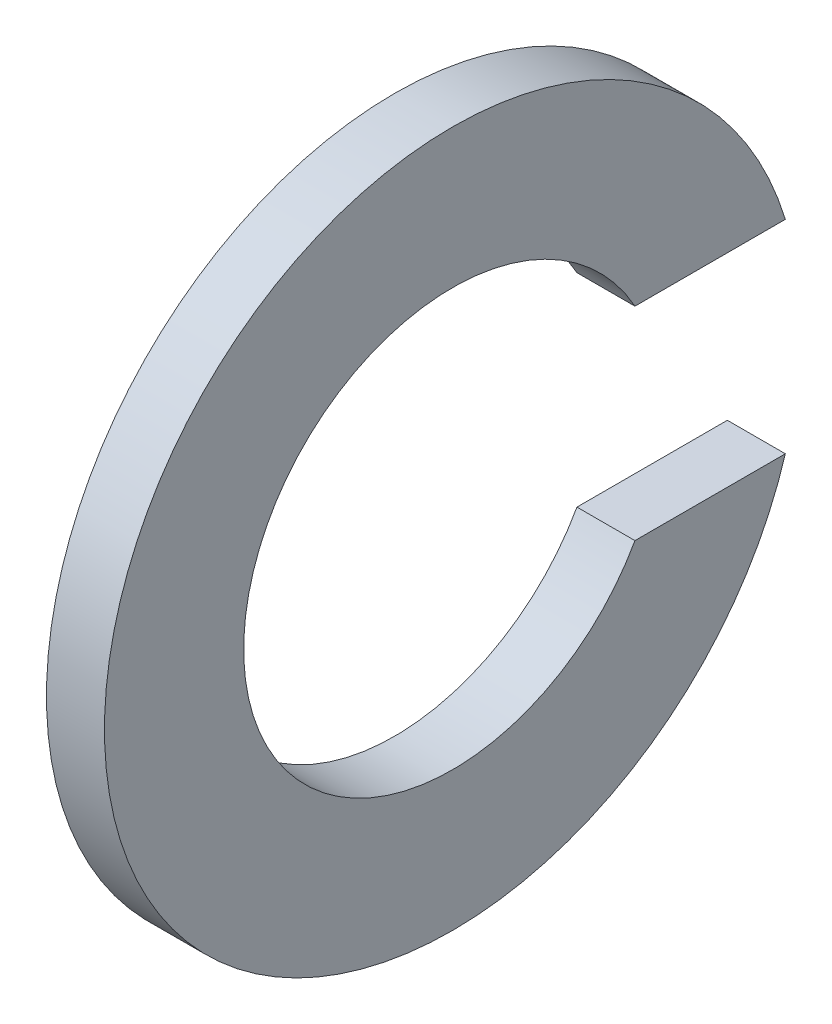
ISO-10303-21;
HEADER;
FILE_DESCRIPTION(('STEP AP214'),'2;1');
FILE_NAME('part.step','',(''),(''),'','','');
FILE_SCHEMA(('AUTOMOTIVE_DESIGN { 1 0 10303 214 1 1 1 1 }'));
ENDSEC;
DATA;
#1=APPLICATION_CONTEXT('core data for automotive mechanical design processes');
#2=APPLICATION_PROTOCOL_DEFINITION('international standard','automotive_design',2000,#1);
#3=PRODUCT_CONTEXT('',#1,'mechanical');
#4=PRODUCT('Part','Part','',(#3));
#5=PRODUCT_RELATED_PRODUCT_CATEGORY('part','',(#4));
#6=PRODUCT_DEFINITION_FORMATION('','',#4);
#7=PRODUCT_DEFINITION_CONTEXT('part definition',#1,'design');
#8=PRODUCT_DEFINITION('design','',#6,#7);
#9=PRODUCT_DEFINITION_SHAPE('','',#8);
#10=(LENGTH_UNIT() NAMED_UNIT(*) SI_UNIT(.MILLI.,.METRE.));
#11=(NAMED_UNIT(*) PLANE_ANGLE_UNIT() SI_UNIT($,.RADIAN.));
#12=(NAMED_UNIT(*) SI_UNIT($,.STERADIAN.) SOLID_ANGLE_UNIT());
#13=UNCERTAINTY_MEASURE_WITH_UNIT(LENGTH_MEASURE(1.E-05),#10,'distance_accuracy_value','');
#14=(GEOMETRIC_REPRESENTATION_CONTEXT(3) GLOBAL_UNCERTAINTY_ASSIGNED_CONTEXT((#13)) GLOBAL_UNIT_ASSIGNED_CONTEXT((#10,
#11,#12)) REPRESENTATION_CONTEXT('',''));
#15=CARTESIAN_POINT('',(0.,0.,0.));
#16=DIRECTION('',(0.,0.,1.));
#17=DIRECTION('',(1.,0.,0.));
#18=AXIS2_PLACEMENT_3D('',#15,#16,#17);
#19=CARTESIAN_POINT('',(0.5,0.,0.));
#20=DIRECTION('',(-1.,0.,0.));
#21=DIRECTION('',(0.,0.,1.));
#22=AXIS2_PLACEMENT_3D('',#19,#20,#21);
#23=CYLINDRICAL_SURFACE('',#22,3.6);
#24=CARTESIAN_POINT('',(-0.5,0.,0.));
#25=DIRECTION('',(-1.,0.,0.));
#26=DIRECTION('',(0.,0.,-1.));
#27=AXIS2_PLACEMENT_3D('',#24,#25,#26);
#28=CIRCLE('',#27,3.6);
#29=CARTESIAN_POINT('',(-0.5,-1.75,-3.14602924334787));
#30=VERTEX_POINT('',#29);
#31=CARTESIAN_POINT('',(-0.5,1.75,-3.14602924334787));
#32=VERTEX_POINT('',#31);
#33=EDGE_CURVE('E100',#30,#32,#28,.T.);
#34=ORIENTED_EDGE('',*,*,#33,.T.);
#35=DIRECTION('',(-1.,0.,0.));
#36=VECTOR('',#35,1.);
#37=CARTESIAN_POINT('',(0.5,1.75,-3.14602924334787));
#38=LINE('',#37,#36);
#39=CARTESIAN_POINT('',(0.5,1.75,-3.14602924334787));
#40=VERTEX_POINT('',#39);
#41=EDGE_CURVE('E11',#40,#32,#38,.T.);
#42=ORIENTED_EDGE('',*,*,#41,.F.);
#43=CARTESIAN_POINT('',(0.5,0.,0.));
#44=DIRECTION('',(-1.,0.,0.));
#45=DIRECTION('',(0.,0.,-1.));
#46=AXIS2_PLACEMENT_3D('',#43,#44,#45);
#47=CIRCLE('',#46,3.6);
#48=CARTESIAN_POINT('',(0.5,-1.75,-3.14602924334787));
#49=VERTEX_POINT('',#48);
#50=EDGE_CURVE('E88',#49,#40,#47,.T.);
#51=ORIENTED_EDGE('',*,*,#50,.F.);
#52=DIRECTION('',(-1.,0.,0.));
#53=VECTOR('',#52,1.);
#54=CARTESIAN_POINT('',(0.5,-1.75,-3.14602924334787));
#55=LINE('',#54,#53);
#56=EDGE_CURVE('E96',#49,#30,#55,.T.);
#57=ORIENTED_EDGE('',*,*,#56,.T.);
#58=EDGE_LOOP('',(#34,#42,#51,#57));
#59=FACE_BOUND('',#58,.T.);
#60=ADVANCED_FACE('F37',(#59),#23,.F.);
#61=CARTESIAN_POINT('',(0.5,1.75,-3.14602924334787));
#62=DIRECTION('',(0.,1.,0.));
#63=DIRECTION('',(0.,0.,1.));
#64=AXIS2_PLACEMENT_3D('',#61,#62,#63);
#65=PLANE('',#64);
#66=DIRECTION('',(0.,0.,-1.));
#67=VECTOR('',#66,1.);
#68=CARTESIAN_POINT('',(-0.5,1.75,-3.14602924334787));
#69=LINE('',#68,#67);
#70=CARTESIAN_POINT('',(-0.5,1.75,-5.7391201416245));
#71=VERTEX_POINT('',#70);
#72=EDGE_CURVE('E92',#32,#71,#69,.T.);
#73=ORIENTED_EDGE('',*,*,#72,.T.);
#74=DIRECTION('',(-1.,0.,0.));
#75=VECTOR('',#74,1.);
#76=CARTESIAN_POINT('',(0.5,1.75,-5.7391201416245));
#77=LINE('',#76,#75);
#78=CARTESIAN_POINT('',(0.5,1.75,-5.7391201416245));
#79=VERTEX_POINT('',#78);
#80=EDGE_CURVE('E45',#79,#71,#77,.T.);
#81=ORIENTED_EDGE('',*,*,#80,.F.);
#82=DIRECTION('',(0.,0.,-1.));
#83=VECTOR('',#82,1.);
#84=CARTESIAN_POINT('',(0.5,1.75,-3.14602924334787));
#85=LINE('',#84,#83);
#86=EDGE_CURVE('E83',#40,#79,#85,.T.);
#87=ORIENTED_EDGE('',*,*,#86,.F.);
#88=ORIENTED_EDGE('',*,*,#41,.T.);
#89=EDGE_LOOP('',(#73,#81,#87,#88));
#90=FACE_BOUND('',#89,.T.);
#91=ADVANCED_FACE('F91',(#90),#65,.F.);
#92=CARTESIAN_POINT('',(0.5,0.,0.));
#93=DIRECTION('',(-1.,0.,0.));
#94=DIRECTION('',(0.,0.,1.));
#95=AXIS2_PLACEMENT_3D('',#92,#93,#94);
#96=CYLINDRICAL_SURFACE('',#95,6.);
#97=CARTESIAN_POINT('',(-0.5,0.,0.));
#98=DIRECTION('',(1.,0.,0.));
#99=DIRECTION('',(0.,0.,-1.));
#100=AXIS2_PLACEMENT_3D('',#97,#98,#99);
#101=CIRCLE('',#100,6.);
#102=CARTESIAN_POINT('',(-0.5,-1.75,-5.7391201416245));
#103=VERTEX_POINT('',#102);
#104=EDGE_CURVE('E70',#71,#103,#101,.T.);
#105=ORIENTED_EDGE('',*,*,#104,.T.);
#106=DIRECTION('',(-1.,0.,0.));
#107=VECTOR('',#106,1.);
#108=CARTESIAN_POINT('',(0.5,-1.75,-5.7391201416245));
#109=LINE('',#108,#107);
#110=CARTESIAN_POINT('',(0.5,-1.75,-5.7391201416245));
#111=VERTEX_POINT('',#110);
#112=EDGE_CURVE('E93',#111,#103,#109,.T.);
#113=ORIENTED_EDGE('',*,*,#112,.F.);
#114=CARTESIAN_POINT('',(0.5,0.,0.));
#115=DIRECTION('',(1.,0.,0.));
#116=DIRECTION('',(0.,0.,-1.));
#117=AXIS2_PLACEMENT_3D('',#114,#115,#116);
#118=CIRCLE('',#117,6.);
#119=EDGE_CURVE('E86',#79,#111,#118,.T.);
#120=ORIENTED_EDGE('',*,*,#119,.F.);
#121=ORIENTED_EDGE('',*,*,#80,.T.);
#122=EDGE_LOOP('',(#105,#113,#120,#121));
#123=FACE_BOUND('',#122,.T.);
#124=ADVANCED_FACE('F94',(#123),#96,.T.);
#125=CARTESIAN_POINT('',(0.5,-1.75,-3.14602924334787));
#126=DIRECTION('',(0.,-1.,0.));
#127=DIRECTION('',(0.,0.,-1.));
#128=AXIS2_PLACEMENT_3D('',#125,#126,#127);
#129=PLANE('',#128);
#130=DIRECTION('',(0.,0.,1.));
#131=VECTOR('',#130,1.);
#132=CARTESIAN_POINT('',(-0.5,-1.75,-3.14602924334787));
#133=LINE('',#132,#131);
#134=EDGE_CURVE('E76',#103,#30,#133,.T.);
#135=ORIENTED_EDGE('',*,*,#134,.T.);
#136=ORIENTED_EDGE('',*,*,#56,.F.);
#137=DIRECTION('',(0.,0.,1.));
#138=VECTOR('',#137,1.);
#139=CARTESIAN_POINT('',(0.5,-1.75,-3.14602924334787));
#140=LINE('',#139,#138);
#141=EDGE_CURVE('E53',#111,#49,#140,.T.);
#142=ORIENTED_EDGE('',*,*,#141,.F.);
#143=ORIENTED_EDGE('',*,*,#112,.T.);
#144=EDGE_LOOP('',(#135,#136,#142,#143));
#145=FACE_BOUND('',#144,.T.);
#146=ADVANCED_FACE('F107',(#145),#129,.F.);
#147=CARTESIAN_POINT('',(0.5,0.,0.));
#148=DIRECTION('',(1.,0.,0.));
#149=DIRECTION('',(0.,0.,-1.));
#150=AXIS2_PLACEMENT_3D('',#147,#148,#149);
#151=PLANE('',#150);
#152=ORIENTED_EDGE('',*,*,#50,.T.);
#153=ORIENTED_EDGE('',*,*,#86,.T.);
#154=ORIENTED_EDGE('',*,*,#119,.T.);
#155=ORIENTED_EDGE('',*,*,#141,.T.);
#156=EDGE_LOOP('',(#152,#153,#154,#155));
#157=FACE_BOUND('',#156,.T.);
#158=ADVANCED_FACE('F84',(#157),#151,.T.);
#159=CARTESIAN_POINT('',(-0.5,0.,0.));
#160=DIRECTION('',(1.,0.,0.));
#161=DIRECTION('',(0.,0.,-1.));
#162=AXIS2_PLACEMENT_3D('',#159,#160,#161);
#163=PLANE('',#162);
#164=ORIENTED_EDGE('',*,*,#33,.F.);
#165=ORIENTED_EDGE('',*,*,#134,.F.);
#166=ORIENTED_EDGE('',*,*,#104,.F.);
#167=ORIENTED_EDGE('',*,*,#72,.F.);
#168=EDGE_LOOP('',(#164,#165,#166,#167));
#169=FACE_BOUND('',#168,.T.);
#170=ADVANCED_FACE('F110',(#169),#163,.F.);
#171=CLOSED_SHELL('',(#60,#91,#124,#146,#158,#170));
#172=MANIFOLD_SOLID_BREP('B2',#171);
#173=ADVANCED_BREP_SHAPE_REPRESENTATION('',(#18,#172),#14);
#174=SHAPE_DEFINITION_REPRESENTATION(#9,#173);
ENDSEC;
END-ISO-10303-21;
